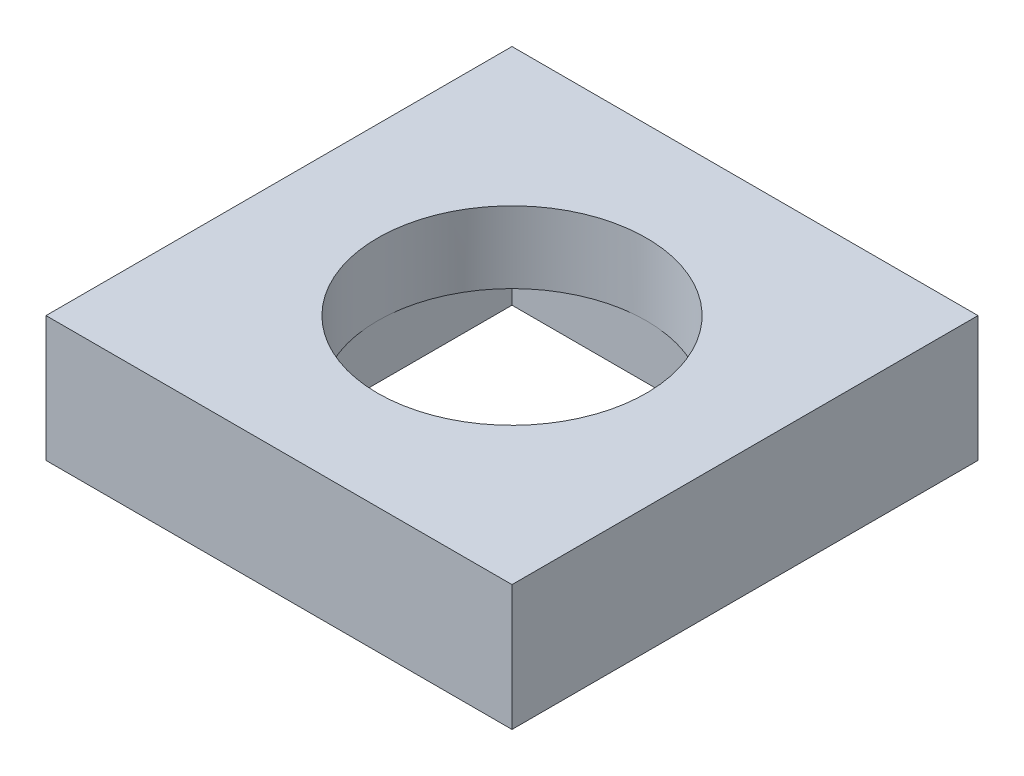
ISO-10303-21;
HEADER;
FILE_DESCRIPTION(('STEP AP214'),'2;1');
FILE_NAME('part.step','',(''),(''),'','','');
FILE_SCHEMA(('AUTOMOTIVE_DESIGN { 1 0 10303 214 1 1 1 1 }'));
ENDSEC;
DATA;
#1=APPLICATION_CONTEXT('core data for automotive mechanical design processes');
#2=APPLICATION_PROTOCOL_DEFINITION('international standard','automotive_design',2000,#1);
#3=PRODUCT_CONTEXT('',#1,'mechanical');
#4=PRODUCT('Part','Part','',(#3));
#5=PRODUCT_RELATED_PRODUCT_CATEGORY('part','',(#4));
#6=PRODUCT_DEFINITION_FORMATION('','',#4);
#7=PRODUCT_DEFINITION_CONTEXT('part definition',#1,'design');
#8=PRODUCT_DEFINITION('design','',#6,#7);
#9=PRODUCT_DEFINITION_SHAPE('','',#8);
#10=(LENGTH_UNIT() NAMED_UNIT(*) SI_UNIT(.MILLI.,.METRE.));
#11=(NAMED_UNIT(*) PLANE_ANGLE_UNIT() SI_UNIT($,.RADIAN.));
#12=(NAMED_UNIT(*) SI_UNIT($,.STERADIAN.) SOLID_ANGLE_UNIT());
#13=UNCERTAINTY_MEASURE_WITH_UNIT(LENGTH_MEASURE(1.E-05),#10,'distance_accuracy_value','');
#14=(GEOMETRIC_REPRESENTATION_CONTEXT(3) GLOBAL_UNCERTAINTY_ASSIGNED_CONTEXT((#13)) GLOBAL_UNIT_ASSIGNED_CONTEXT((#10,
#11,#12)) REPRESENTATION_CONTEXT('',''));
#15=CARTESIAN_POINT('',(0.,0.,0.));
#16=DIRECTION('',(0.,0.,1.));
#17=DIRECTION('',(1.,0.,0.));
#18=AXIS2_PLACEMENT_3D('',#15,#16,#17);
#19=CARTESIAN_POINT('',(-0.311764705882353,0.7,0.709625668449197));
#20=DIRECTION('',(0.,-1.,0.));
#21=DIRECTION('',(0.,0.,-1.));
#22=AXIS2_PLACEMENT_3D('',#19,#20,#21);
#23=CYLINDRICAL_SURFACE('',#22,0.75);
#24=CARTESIAN_POINT('',(-0.311764705882353,0.7,0.709625668449197));
#25=DIRECTION('',(0.,1.,0.));
#26=DIRECTION('',(0.,0.,1.));
#27=AXIS2_PLACEMENT_3D('',#24,#25,#26);
#28=CIRCLE('',#27,0.75);
#29=CARTESIAN_POINT('',(-0.311764705882353,0.7,1.4596256684492));
#30=VERTEX_POINT('',#29);
#31=EDGE_CURVE('E148',#30,#30,#28,.T.);
#32=ORIENTED_EDGE('',*,*,#31,.T.);
#33=EDGE_LOOP('',(#32));
#34=FACE_BOUND('',#33,.T.);
#35=CARTESIAN_POINT('',(-0.311764705882353,0.3,0.709625668449197));
#36=DIRECTION('',(0.,-1.,0.));
#37=DIRECTION('',(0.,0.,-1.));
#38=AXIS2_PLACEMENT_3D('',#35,#36,#37);
#39=CIRCLE('',#38,0.75);
#40=CARTESIAN_POINT('',(-1.06176470588235,0.3,0.709625668449197));
#41=VERTEX_POINT('',#40);
#42=CARTESIAN_POINT('',(-0.311764705882353,0.3,-0.0403743315508024));
#43=VERTEX_POINT('',#42);
#44=EDGE_CURVE('E38',#41,#43,#39,.T.);
#45=ORIENTED_EDGE('',*,*,#44,.T.);
#46=CARTESIAN_POINT('',(0.438235294117647,0.3,0.709625668449197));
#47=VERTEX_POINT('',#46);
#48=EDGE_CURVE('E11',#43,#47,#39,.T.);
#49=ORIENTED_EDGE('',*,*,#48,.T.);
#50=CARTESIAN_POINT('',(-0.311764705882353,0.3,1.4596256684492));
#51=VERTEX_POINT('',#50);
#52=EDGE_CURVE('E43',#47,#51,#39,.T.);
#53=ORIENTED_EDGE('',*,*,#52,.T.);
#54=EDGE_CURVE('E186',#51,#41,#39,.T.);
#55=ORIENTED_EDGE('',*,*,#54,.T.);
#56=EDGE_LOOP('',(#45,#49,#53,#55));
#57=FACE_BOUND('',#56,.T.);
#58=ADVANCED_FACE('F34',(#34,#57),#23,.F.);
#59=CARTESIAN_POINT('',(0.,0.7,0.));
#60=DIRECTION('',(0.,1.,0.));
#61=DIRECTION('',(0.,0.,1.));
#62=AXIS2_PLACEMENT_3D('',#59,#60,#61);
#63=PLANE('',#62);
#64=DIRECTION('',(0.,0.,1.));
#65=VECTOR('',#64,1.);
#66=CARTESIAN_POINT('',(-1.61176470588235,0.7,-0.590374331550802));
#67=LINE('',#66,#65);
#68=CARTESIAN_POINT('',(-1.61176470588235,0.7,-0.590374331550802));
#69=VERTEX_POINT('',#68);
#70=CARTESIAN_POINT('',(-1.61176470588235,0.7,2.0096256684492));
#71=VERTEX_POINT('',#70);
#72=EDGE_CURVE('E157',#69,#71,#67,.T.);
#73=ORIENTED_EDGE('',*,*,#72,.T.);
#74=DIRECTION('',(1.,0.,0.));
#75=VECTOR('',#74,1.);
#76=CARTESIAN_POINT('',(-1.61176470588235,0.7,2.0096256684492));
#77=LINE('',#76,#75);
#78=CARTESIAN_POINT('',(0.988235294117647,0.7,2.0096256684492));
#79=VERTEX_POINT('',#78);
#80=EDGE_CURVE('E160',#71,#79,#77,.T.);
#81=ORIENTED_EDGE('',*,*,#80,.T.);
#82=DIRECTION('',(0.,0.,-1.));
#83=VECTOR('',#82,1.);
#84=CARTESIAN_POINT('',(0.988235294117647,0.7,-0.590374331550802));
#85=LINE('',#84,#83);
#86=CARTESIAN_POINT('',(0.988235294117647,0.7,-0.590374331550802));
#87=VERTEX_POINT('',#86);
#88=EDGE_CURVE('E163',#79,#87,#85,.T.);
#89=ORIENTED_EDGE('',*,*,#88,.T.);
#90=DIRECTION('',(-1.,0.,0.));
#91=VECTOR('',#90,1.);
#92=CARTESIAN_POINT('',(-1.61176470588235,0.7,-0.590374331550802));
#93=LINE('',#92,#91);
#94=EDGE_CURVE('E165',#87,#69,#93,.T.);
#95=ORIENTED_EDGE('',*,*,#94,.T.);
#96=EDGE_LOOP('',(#73,#81,#89,#95));
#97=FACE_BOUND('',#96,.T.);
#98=ORIENTED_EDGE('',*,*,#31,.F.);
#99=EDGE_LOOP('',(#98));
#100=FACE_BOUND('',#99,.T.);
#101=ADVANCED_FACE('F218',(#97,#100),#63,.T.);
#102=CARTESIAN_POINT('',(0.,0.,0.));
#103=DIRECTION('',(0.,1.,0.));
#104=DIRECTION('',(0.,0.,1.));
#105=AXIS2_PLACEMENT_3D('',#102,#103,#104);
#106=PLANE('',#105);
#107=DIRECTION('',(0.,0.,1.));
#108=VECTOR('',#107,1.);
#109=CARTESIAN_POINT('',(-1.61176470588235,0.,-0.590374331550802));
#110=LINE('',#109,#108);
#111=CARTESIAN_POINT('',(-1.61176470588235,0.,-0.590374331550802));
#112=VERTEX_POINT('',#111);
#113=CARTESIAN_POINT('',(-1.61176470588235,0.,2.0096256684492));
#114=VERTEX_POINT('',#113);
#115=EDGE_CURVE('E156',#112,#114,#110,.T.);
#116=ORIENTED_EDGE('',*,*,#115,.F.);
#117=DIRECTION('',(-1.,0.,0.));
#118=VECTOR('',#117,1.);
#119=CARTESIAN_POINT('',(-1.61176470588235,0.,-0.590374331550802));
#120=LINE('',#119,#118);
#121=CARTESIAN_POINT('',(0.988235294117647,0.,-0.590374331550802));
#122=VERTEX_POINT('',#121);
#123=EDGE_CURVE('E161',#122,#112,#120,.T.);
#124=ORIENTED_EDGE('',*,*,#123,.F.);
#125=DIRECTION('',(0.,0.,-1.));
#126=VECTOR('',#125,1.);
#127=CARTESIAN_POINT('',(0.988235294117647,0.,-0.590374331550802));
#128=LINE('',#127,#126);
#129=CARTESIAN_POINT('',(0.988235294117647,0.,2.0096256684492));
#130=VERTEX_POINT('',#129);
#131=EDGE_CURVE('E172',#130,#122,#128,.T.);
#132=ORIENTED_EDGE('',*,*,#131,.F.);
#133=DIRECTION('',(1.,0.,0.));
#134=VECTOR('',#133,1.);
#135=CARTESIAN_POINT('',(-1.61176470588235,0.,2.0096256684492));
#136=LINE('',#135,#134);
#137=EDGE_CURVE('E170',#114,#130,#136,.T.);
#138=ORIENTED_EDGE('',*,*,#137,.F.);
#139=EDGE_LOOP('',(#116,#124,#132,#138));
#140=FACE_BOUND('',#139,.T.);
#141=DIRECTION('',(1.,0.,0.));
#142=VECTOR('',#141,1.);
#143=CARTESIAN_POINT('',(-1.06176470588235,0.,-0.0403743315508026));
#144=LINE('',#143,#142);
#145=CARTESIAN_POINT('',(-1.06176470588235,0.,-0.0403743315508026));
#146=VERTEX_POINT('',#145);
#147=CARTESIAN_POINT('',(0.438235294117647,0.,-0.0403743315508026));
#148=VERTEX_POINT('',#147);
#149=EDGE_CURVE('E141',#146,#148,#144,.T.);
#150=ORIENTED_EDGE('',*,*,#149,.F.);
#151=DIRECTION('',(0.,0.,-1.));
#152=VECTOR('',#151,1.);
#153=CARTESIAN_POINT('',(-1.06176470588235,0.,1.4596256684492));
#154=LINE('',#153,#152);
#155=CARTESIAN_POINT('',(-1.06176470588235,0.,1.4596256684492));
#156=VERTEX_POINT('',#155);
#157=EDGE_CURVE('E50',#156,#146,#154,.T.);
#158=ORIENTED_EDGE('',*,*,#157,.F.);
#159=DIRECTION('',(-1.,0.,0.));
#160=VECTOR('',#159,1.);
#161=CARTESIAN_POINT('',(-1.06176470588235,0.,1.4596256684492));
#162=LINE('',#161,#160);
#163=CARTESIAN_POINT('',(0.438235294117647,0.,1.4596256684492));
#164=VERTEX_POINT('',#163);
#165=EDGE_CURVE('E118',#164,#156,#162,.T.);
#166=ORIENTED_EDGE('',*,*,#165,.F.);
#167=DIRECTION('',(0.,0.,1.));
#168=VECTOR('',#167,1.);
#169=CARTESIAN_POINT('',(0.438235294117647,0.,1.4596256684492));
#170=LINE('',#169,#168);
#171=EDGE_CURVE('E143',#148,#164,#170,.T.);
#172=ORIENTED_EDGE('',*,*,#171,.F.);
#173=EDGE_LOOP('',(#150,#158,#166,#172));
#174=FACE_BOUND('',#173,.T.);
#175=ADVANCED_FACE('F203',(#140,#174),#106,.F.);
#176=CARTESIAN_POINT('',(-1.61176470588235,0.7,-0.590374331550802));
#177=DIRECTION('',(1.,0.,0.));
#178=DIRECTION('',(0.,0.,-1.));
#179=AXIS2_PLACEMENT_3D('',#176,#177,#178);
#180=PLANE('',#179);
#181=ORIENTED_EDGE('',*,*,#115,.T.);
#182=DIRECTION('',(0.,-1.,0.));
#183=VECTOR('',#182,1.);
#184=CARTESIAN_POINT('',(-1.61176470588235,0.7,2.0096256684492));
#185=LINE('',#184,#183);
#186=EDGE_CURVE('E182',#71,#114,#185,.T.);
#187=ORIENTED_EDGE('',*,*,#186,.F.);
#188=ORIENTED_EDGE('',*,*,#72,.F.);
#189=DIRECTION('',(0.,-1.,0.));
#190=VECTOR('',#189,1.);
#191=CARTESIAN_POINT('',(-1.61176470588235,0.7,-0.590374331550802));
#192=LINE('',#191,#190);
#193=EDGE_CURVE('E167',#69,#112,#192,.T.);
#194=ORIENTED_EDGE('',*,*,#193,.T.);
#195=EDGE_LOOP('',(#181,#187,#188,#194));
#196=FACE_BOUND('',#195,.T.);
#197=ADVANCED_FACE('F36',(#196),#180,.F.);
#198=CARTESIAN_POINT('',(-1.61176470588235,0.7,2.0096256684492));
#199=DIRECTION('',(0.,0.,-1.));
#200=DIRECTION('',(-1.,0.,0.));
#201=AXIS2_PLACEMENT_3D('',#198,#199,#200);
#202=PLANE('',#201);
#203=ORIENTED_EDGE('',*,*,#137,.T.);
#204=DIRECTION('',(0.,-1.,0.));
#205=VECTOR('',#204,1.);
#206=CARTESIAN_POINT('',(0.988235294117647,0.7,2.0096256684492));
#207=LINE('',#206,#205);
#208=EDGE_CURVE('E180',#79,#130,#207,.T.);
#209=ORIENTED_EDGE('',*,*,#208,.F.);
#210=ORIENTED_EDGE('',*,*,#80,.F.);
#211=ORIENTED_EDGE('',*,*,#186,.T.);
#212=EDGE_LOOP('',(#203,#209,#210,#211));
#213=FACE_BOUND('',#212,.T.);
#214=ADVANCED_FACE('F238',(#213),#202,.F.);
#215=CARTESIAN_POINT('',(0.988235294117647,0.7,-0.590374331550802));
#216=DIRECTION('',(-1.,0.,0.));
#217=DIRECTION('',(0.,0.,1.));
#218=AXIS2_PLACEMENT_3D('',#215,#216,#217);
#219=PLANE('',#218);
#220=ORIENTED_EDGE('',*,*,#131,.T.);
#221=DIRECTION('',(0.,-1.,0.));
#222=VECTOR('',#221,1.);
#223=CARTESIAN_POINT('',(0.988235294117647,0.7,-0.590374331550802));
#224=LINE('',#223,#222);
#225=EDGE_CURVE('E177',#87,#122,#224,.T.);
#226=ORIENTED_EDGE('',*,*,#225,.F.);
#227=ORIENTED_EDGE('',*,*,#88,.F.);
#228=ORIENTED_EDGE('',*,*,#208,.T.);
#229=EDGE_LOOP('',(#220,#226,#227,#228));
#230=FACE_BOUND('',#229,.T.);
#231=ADVANCED_FACE('F235',(#230),#219,.F.);
#232=CARTESIAN_POINT('',(-1.61176470588235,0.7,-0.590374331550802));
#233=DIRECTION('',(0.,0.,1.));
#234=DIRECTION('',(1.,0.,0.));
#235=AXIS2_PLACEMENT_3D('',#232,#233,#234);
#236=PLANE('',#235);
#237=ORIENTED_EDGE('',*,*,#123,.T.);
#238=ORIENTED_EDGE('',*,*,#193,.F.);
#239=ORIENTED_EDGE('',*,*,#94,.F.);
#240=ORIENTED_EDGE('',*,*,#225,.T.);
#241=EDGE_LOOP('',(#237,#238,#239,#240));
#242=FACE_BOUND('',#241,.T.);
#243=ADVANCED_FACE('F232',(#242),#236,.F.);
#244=CARTESIAN_POINT('',(-1.06176470588235,0.3,1.4596256684492));
#245=DIRECTION('',(-1.,0.,0.));
#246=DIRECTION('',(0.,0.,1.));
#247=AXIS2_PLACEMENT_3D('',#244,#245,#246);
#248=PLANE('',#247);
#249=DIRECTION('',(0.,0.,-1.));
#250=VECTOR('',#249,1.);
#251=CARTESIAN_POINT('',(-1.06176470588235,0.3,1.4596256684492));
#252=LINE('',#251,#250);
#253=CARTESIAN_POINT('',(-1.06176470588235,0.3,1.4596256684492));
#254=VERTEX_POINT('',#253);
#255=EDGE_CURVE('E117',#254,#41,#252,.T.);
#256=ORIENTED_EDGE('',*,*,#255,.F.);
#257=DIRECTION('',(0.,-1.,0.));
#258=VECTOR('',#257,1.);
#259=CARTESIAN_POINT('',(-1.06176470588235,0.3,1.4596256684492));
#260=LINE('',#259,#258);
#261=EDGE_CURVE('E146',#254,#156,#260,.T.);
#262=ORIENTED_EDGE('',*,*,#261,.T.);
#263=ORIENTED_EDGE('',*,*,#157,.T.);
#264=DIRECTION('',(0.,-1.,0.));
#265=VECTOR('',#264,1.);
#266=CARTESIAN_POINT('',(-1.06176470588235,0.3,-0.0403743315508026));
#267=LINE('',#266,#265);
#268=CARTESIAN_POINT('',(-1.06176470588235,0.3,-0.0403743315508026));
#269=VERTEX_POINT('',#268);
#270=EDGE_CURVE('E121',#269,#146,#267,.T.);
#271=ORIENTED_EDGE('',*,*,#270,.F.);
#272=EDGE_CURVE('E112',#41,#269,#252,.T.);
#273=ORIENTED_EDGE('',*,*,#272,.F.);
#274=EDGE_LOOP('',(#256,#262,#263,#271,#273));
#275=FACE_BOUND('',#274,.T.);
#276=ADVANCED_FACE('F122',(#275),#248,.F.);
#277=CARTESIAN_POINT('',(-1.06176470588235,0.3,1.4596256684492));
#278=DIRECTION('',(0.,0.,1.));
#279=DIRECTION('',(1.,0.,0.));
#280=AXIS2_PLACEMENT_3D('',#277,#278,#279);
#281=PLANE('',#280);
#282=DIRECTION('',(-1.,0.,0.));
#283=VECTOR('',#282,1.);
#284=CARTESIAN_POINT('',(-1.06176470588235,0.3,1.4596256684492));
#285=LINE('',#284,#283);
#286=CARTESIAN_POINT('',(0.438235294117647,0.3,1.4596256684492));
#287=VERTEX_POINT('',#286);
#288=EDGE_CURVE('E125',#287,#51,#285,.T.);
#289=ORIENTED_EDGE('',*,*,#288,.F.);
#290=DIRECTION('',(0.,-1.,0.));
#291=VECTOR('',#290,1.);
#292=CARTESIAN_POINT('',(0.438235294117647,0.3,1.4596256684492));
#293=LINE('',#292,#291);
#294=EDGE_CURVE('E149',#287,#164,#293,.T.);
#295=ORIENTED_EDGE('',*,*,#294,.T.);
#296=ORIENTED_EDGE('',*,*,#165,.T.);
#297=ORIENTED_EDGE('',*,*,#261,.F.);
#298=EDGE_CURVE('E137',#51,#254,#285,.T.);
#299=ORIENTED_EDGE('',*,*,#298,.F.);
#300=EDGE_LOOP('',(#289,#295,#296,#297,#299));
#301=FACE_BOUND('',#300,.T.);
#302=ADVANCED_FACE('F206',(#301),#281,.F.);
#303=CARTESIAN_POINT('',(0.438235294117647,0.3,1.4596256684492));
#304=DIRECTION('',(1.,0.,0.));
#305=DIRECTION('',(0.,0.,-1.));
#306=AXIS2_PLACEMENT_3D('',#303,#304,#305);
#307=PLANE('',#306);
#308=DIRECTION('',(0.,0.,1.));
#309=VECTOR('',#308,1.);
#310=CARTESIAN_POINT('',(0.438235294117647,0.3,1.4596256684492));
#311=LINE('',#310,#309);
#312=CARTESIAN_POINT('',(0.438235294117647,0.3,-0.0403743315508026));
#313=VERTEX_POINT('',#312);
#314=EDGE_CURVE('E133',#313,#47,#311,.T.);
#315=ORIENTED_EDGE('',*,*,#314,.F.);
#316=DIRECTION('',(0.,-1.,0.));
#317=VECTOR('',#316,1.);
#318=CARTESIAN_POINT('',(0.438235294117647,0.3,-0.0403743315508026));
#319=LINE('',#318,#317);
#320=EDGE_CURVE('E124',#313,#148,#319,.T.);
#321=ORIENTED_EDGE('',*,*,#320,.T.);
#322=ORIENTED_EDGE('',*,*,#171,.T.);
#323=ORIENTED_EDGE('',*,*,#294,.F.);
#324=EDGE_CURVE('E131',#47,#287,#311,.T.);
#325=ORIENTED_EDGE('',*,*,#324,.F.);
#326=EDGE_LOOP('',(#315,#321,#322,#323,#325));
#327=FACE_BOUND('',#326,.T.);
#328=ADVANCED_FACE('F197',(#327),#307,.F.);
#329=CARTESIAN_POINT('',(-1.06176470588235,0.3,-0.0403743315508026));
#330=DIRECTION('',(0.,0.,-1.));
#331=DIRECTION('',(-1.,0.,0.));
#332=AXIS2_PLACEMENT_3D('',#329,#330,#331);
#333=PLANE('',#332);
#334=DIRECTION('',(1.,0.,0.));
#335=VECTOR('',#334,1.);
#336=CARTESIAN_POINT('',(-1.06176470588235,0.3,-0.0403743315508026));
#337=LINE('',#336,#335);
#338=EDGE_CURVE('E58',#269,#43,#337,.T.);
#339=ORIENTED_EDGE('',*,*,#338,.F.);
#340=ORIENTED_EDGE('',*,*,#270,.T.);
#341=ORIENTED_EDGE('',*,*,#149,.T.);
#342=ORIENTED_EDGE('',*,*,#320,.F.);
#343=EDGE_CURVE('E129',#43,#313,#337,.T.);
#344=ORIENTED_EDGE('',*,*,#343,.F.);
#345=EDGE_LOOP('',(#339,#340,#341,#342,#344));
#346=FACE_BOUND('',#345,.T.);
#347=ADVANCED_FACE('F127',(#346),#333,.F.);
#348=CARTESIAN_POINT('',(0.,0.3,0.));
#349=DIRECTION('',(0.,-1.,0.));
#350=DIRECTION('',(0.,0.,-1.));
#351=AXIS2_PLACEMENT_3D('',#348,#349,#350);
#352=PLANE('',#351);
#353=ORIENTED_EDGE('',*,*,#343,.T.);
#354=ORIENTED_EDGE('',*,*,#314,.T.);
#355=ORIENTED_EDGE('',*,*,#48,.F.);
#356=EDGE_LOOP('',(#353,#354,#355));
#357=FACE_BOUND('',#356,.T.);
#358=ADVANCED_FACE('F199',(#357),#352,.T.);
#359=ORIENTED_EDGE('',*,*,#324,.T.);
#360=ORIENTED_EDGE('',*,*,#288,.T.);
#361=ORIENTED_EDGE('',*,*,#52,.F.);
#362=EDGE_LOOP('',(#359,#360,#361));
#363=FACE_BOUND('',#362,.T.);
#364=ADVANCED_FACE('F192',(#363),#352,.T.);
#365=ORIENTED_EDGE('',*,*,#298,.T.);
#366=ORIENTED_EDGE('',*,*,#255,.T.);
#367=ORIENTED_EDGE('',*,*,#54,.F.);
#368=EDGE_LOOP('',(#365,#366,#367));
#369=FACE_BOUND('',#368,.T.);
#370=ADVANCED_FACE('F209',(#369),#352,.T.);
#371=ORIENTED_EDGE('',*,*,#272,.T.);
#372=ORIENTED_EDGE('',*,*,#338,.T.);
#373=ORIENTED_EDGE('',*,*,#44,.F.);
#374=EDGE_LOOP('',(#371,#372,#373));
#375=FACE_BOUND('',#374,.T.);
#376=ADVANCED_FACE('F113',(#375),#352,.T.);
#377=CLOSED_SHELL('',(#58,#101,#175,#197,#214,#231,#243,#276,#302,#328,#347,#358,#364,#370,#376));
#378=MANIFOLD_SOLID_BREP('B2',#377);
#379=ADVANCED_BREP_SHAPE_REPRESENTATION('',(#18,#378),#14);
#380=SHAPE_DEFINITION_REPRESENTATION(#9,#379);
ENDSEC;
END-ISO-10303-21;
